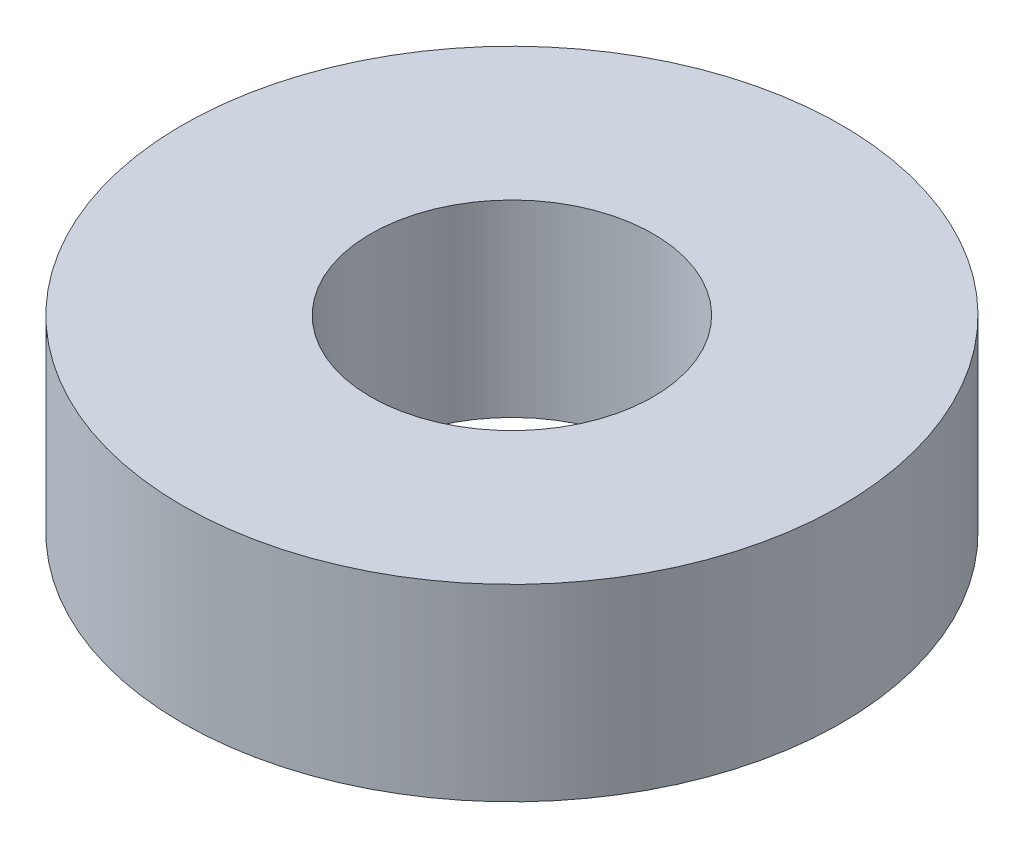
ISO-10303-21;
HEADER;
FILE_DESCRIPTION(('STEP AP214'),'2;1');
FILE_NAME('part.step','',(''),(''),'','','');
FILE_SCHEMA(('AUTOMOTIVE_DESIGN { 1 0 10303 214 1 1 1 1 }'));
ENDSEC;
DATA;
#1=APPLICATION_CONTEXT('core data for automotive mechanical design processes');
#2=APPLICATION_PROTOCOL_DEFINITION('international standard','automotive_design',2000,#1);
#3=PRODUCT_CONTEXT('',#1,'mechanical');
#4=PRODUCT('Part','Part','',(#3));
#5=PRODUCT_RELATED_PRODUCT_CATEGORY('part','',(#4));
#6=PRODUCT_DEFINITION_FORMATION('','',#4);
#7=PRODUCT_DEFINITION_CONTEXT('part definition',#1,'design');
#8=PRODUCT_DEFINITION('design','',#6,#7);
#9=PRODUCT_DEFINITION_SHAPE('','',#8);
#10=(LENGTH_UNIT() NAMED_UNIT(*) SI_UNIT(.MILLI.,.METRE.));
#11=(NAMED_UNIT(*) PLANE_ANGLE_UNIT() SI_UNIT($,.RADIAN.));
#12=(NAMED_UNIT(*) SI_UNIT($,.STERADIAN.) SOLID_ANGLE_UNIT());
#13=UNCERTAINTY_MEASURE_WITH_UNIT(LENGTH_MEASURE(1.E-05),#10,'distance_accuracy_value','');
#14=(GEOMETRIC_REPRESENTATION_CONTEXT(3) GLOBAL_UNCERTAINTY_ASSIGNED_CONTEXT((#13)) GLOBAL_UNIT_ASSIGNED_CONTEXT((#10,
#11,#12)) REPRESENTATION_CONTEXT('',''));
#15=CARTESIAN_POINT('',(0.,0.,0.));
#16=DIRECTION('',(0.,0.,1.));
#17=DIRECTION('',(1.,0.,0.));
#18=AXIS2_PLACEMENT_3D('',#15,#16,#17);
#19=CARTESIAN_POINT('',(0.,8.,0.));
#20=DIRECTION('',(0.,1.,0.));
#21=DIRECTION('',(0.,0.,1.));
#22=AXIS2_PLACEMENT_3D('',#19,#20,#21);
#23=PLANE('',#22);
#24=CARTESIAN_POINT('',(0.,8.,0.));
#25=DIRECTION('',(0.,1.,0.));
#26=DIRECTION('',(0.,0.,1.));
#27=AXIS2_PLACEMENT_3D('',#24,#25,#26);
#28=CIRCLE('',#27,14.);
#29=CARTESIAN_POINT('',(0.,8.,14.));
#30=VERTEX_POINT('',#29);
#31=EDGE_CURVE('E10',#30,#30,#28,.T.);
#32=ORIENTED_EDGE('',*,*,#31,.T.);
#33=EDGE_LOOP('',(#32));
#34=FACE_BOUND('',#33,.T.);
#35=CARTESIAN_POINT('',(0.,8.,0.));
#36=DIRECTION('',(0.,1.,0.));
#37=DIRECTION('',(0.,0.,1.));
#38=AXIS2_PLACEMENT_3D('',#35,#36,#37);
#39=CIRCLE('',#38,6.);
#40=CARTESIAN_POINT('',(0.,8.,6.));
#41=VERTEX_POINT('',#40);
#42=EDGE_CURVE('E44',#41,#41,#39,.T.);
#43=ORIENTED_EDGE('',*,*,#42,.F.);
#44=EDGE_LOOP('',(#43));
#45=FACE_BOUND('',#44,.T.);
#46=ADVANCED_FACE('F33',(#34,#45),#23,.T.);
#47=CARTESIAN_POINT('',(0.,0.,0.));
#48=DIRECTION('',(0.,1.,0.));
#49=DIRECTION('',(0.,0.,1.));
#50=AXIS2_PLACEMENT_3D('',#47,#48,#49);
#51=PLANE('',#50);
#52=CARTESIAN_POINT('',(0.,0.,0.));
#53=DIRECTION('',(0.,1.,0.));
#54=DIRECTION('',(0.,0.,1.));
#55=AXIS2_PLACEMENT_3D('',#52,#53,#54);
#56=CIRCLE('',#55,14.);
#57=CARTESIAN_POINT('',(0.,0.,14.));
#58=VERTEX_POINT('',#57);
#59=EDGE_CURVE('E37',#58,#58,#56,.T.);
#60=ORIENTED_EDGE('',*,*,#59,.F.);
#61=EDGE_LOOP('',(#60));
#62=FACE_BOUND('',#61,.T.);
#63=CARTESIAN_POINT('',(0.,0.,0.));
#64=DIRECTION('',(0.,1.,0.));
#65=DIRECTION('',(0.,0.,1.));
#66=AXIS2_PLACEMENT_3D('',#63,#64,#65);
#67=CIRCLE('',#66,6.);
#68=CARTESIAN_POINT('',(0.,0.,6.));
#69=VERTEX_POINT('',#68);
#70=EDGE_CURVE('E46',#69,#69,#67,.T.);
#71=ORIENTED_EDGE('',*,*,#70,.T.);
#72=EDGE_LOOP('',(#71));
#73=FACE_BOUND('',#72,.T.);
#74=ADVANCED_FACE('F56',(#62,#73),#51,.F.);
#75=CARTESIAN_POINT('',(0.,8.,0.));
#76=DIRECTION('',(0.,-1.,0.));
#77=DIRECTION('',(0.,0.,-1.));
#78=AXIS2_PLACEMENT_3D('',#75,#76,#77);
#79=CYLINDRICAL_SURFACE('',#78,14.);
#80=ORIENTED_EDGE('',*,*,#31,.F.);
#81=EDGE_LOOP('',(#80));
#82=FACE_BOUND('',#81,.T.);
#83=ORIENTED_EDGE('',*,*,#59,.T.);
#84=EDGE_LOOP('',(#83));
#85=FACE_BOUND('',#84,.T.);
#86=ADVANCED_FACE('F35',(#82,#85),#79,.T.);
#87=CARTESIAN_POINT('',(0.,8.,0.));
#88=DIRECTION('',(0.,-1.,0.));
#89=DIRECTION('',(0.,0.,-1.));
#90=AXIS2_PLACEMENT_3D('',#87,#88,#89);
#91=CYLINDRICAL_SURFACE('',#90,6.);
#92=ORIENTED_EDGE('',*,*,#42,.T.);
#93=EDGE_LOOP('',(#92));
#94=FACE_BOUND('',#93,.T.);
#95=ORIENTED_EDGE('',*,*,#70,.F.);
#96=EDGE_LOOP('',(#95));
#97=FACE_BOUND('',#96,.T.);
#98=ADVANCED_FACE('F52',(#94,#97),#91,.F.);
#99=CLOSED_SHELL('',(#46,#74,#86,#98));
#100=MANIFOLD_SOLID_BREP('B2',#99);
#101=ADVANCED_BREP_SHAPE_REPRESENTATION('',(#18,#100),#14);
#102=SHAPE_DEFINITION_REPRESENTATION(#9,#101);
ENDSEC;
END-ISO-10303-21;
